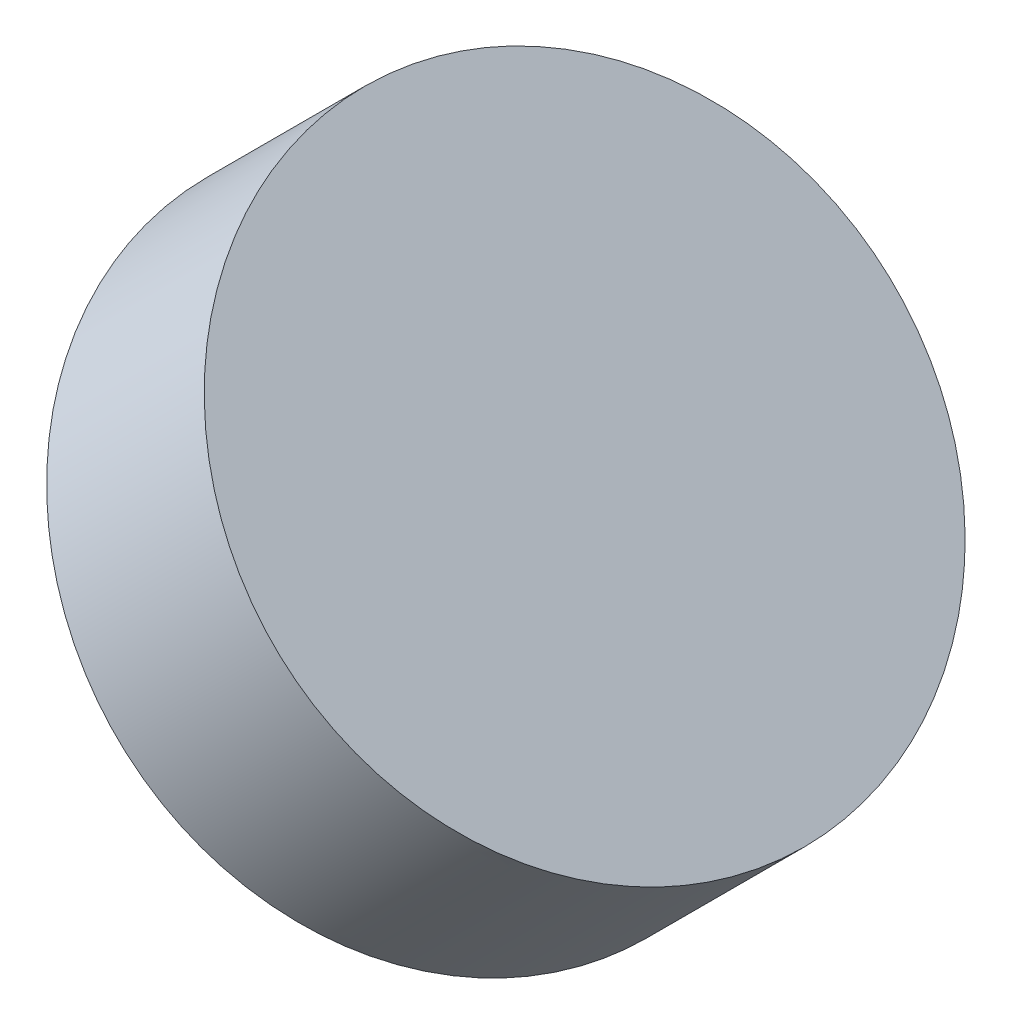
ISO-10303-21;
HEADER;
FILE_DESCRIPTION(('STEP AP214'),'2;1');
FILE_NAME('part.step','',(''),(''),'','','');
FILE_SCHEMA(('AUTOMOTIVE_DESIGN { 1 0 10303 214 1 1 1 1 }'));
ENDSEC;
DATA;
#1=APPLICATION_CONTEXT('core data for automotive mechanical design processes');
#2=APPLICATION_PROTOCOL_DEFINITION('international standard','automotive_design',2000,#1);
#3=PRODUCT_CONTEXT('',#1,'mechanical');
#4=PRODUCT('Part','Part','',(#3));
#5=PRODUCT_RELATED_PRODUCT_CATEGORY('part','',(#4));
#6=PRODUCT_DEFINITION_FORMATION('','',#4);
#7=PRODUCT_DEFINITION_CONTEXT('part definition',#1,'design');
#8=PRODUCT_DEFINITION('design','',#6,#7);
#9=PRODUCT_DEFINITION_SHAPE('','',#8);
#10=(LENGTH_UNIT() NAMED_UNIT(*) SI_UNIT(.MILLI.,.METRE.));
#11=(NAMED_UNIT(*) PLANE_ANGLE_UNIT() SI_UNIT($,.RADIAN.));
#12=(NAMED_UNIT(*) SI_UNIT($,.STERADIAN.) SOLID_ANGLE_UNIT());
#13=UNCERTAINTY_MEASURE_WITH_UNIT(LENGTH_MEASURE(1.E-05),#10,'distance_accuracy_value','');
#14=(GEOMETRIC_REPRESENTATION_CONTEXT(3) GLOBAL_UNCERTAINTY_ASSIGNED_CONTEXT((#13)) GLOBAL_UNIT_ASSIGNED_CONTEXT((#10,
#11,#12)) REPRESENTATION_CONTEXT('',''));
#15=CARTESIAN_POINT('',(0.,0.,0.));
#16=DIRECTION('',(0.,0.,1.));
#17=DIRECTION('',(1.,0.,0.));
#18=AXIS2_PLACEMENT_3D('',#15,#16,#17);
#19=CARTESIAN_POINT('',(15.2061360649185,25.4883691119521,12.5));
#20=CARTESIAN_POINT('',(15.2061360649185,25.4883691119521,12.6682299792076));
#21=CARTESIAN_POINT('',(15.2534599264889,25.4410452503816,13.0046899376229));
#22=CARTESIAN_POINT('',(15.4556103601578,25.2388948167128,13.4325454072684));
#23=CARTESIAN_POINT('',(15.7581498641119,24.9363553127587,13.7184292922025));
#24=CARTESIAN_POINT('',(16.1150195414016,24.5794856354689,13.8188183624877));
#25=CARTESIAN_POINT('',(16.4718892186914,24.2226159581791,13.7184292922025));
#26=CARTESIAN_POINT('',(16.7744287226455,23.920076454225,13.4325454072684));
#27=CARTESIAN_POINT('',(16.9765791563143,23.7179260205562,13.0046899376229));
#28=CARTESIAN_POINT('',(17.0475649486701,23.6469402282005,12.5));
#29=CARTESIAN_POINT('',(16.9765791563143,23.7179260205562,11.9953100623771));
#30=CARTESIAN_POINT('',(16.7744287226455,23.920076454225,11.5674545927316));
#31=CARTESIAN_POINT('',(16.4718892186914,24.2226159581791,11.2815707077975));
#32=CARTESIAN_POINT('',(16.1150195414016,24.5794856354689,11.1811816375123));
#33=CARTESIAN_POINT('',(15.7581498641118,24.9363553127587,11.2815707077975));
#34=CARTESIAN_POINT('',(15.4556103601578,25.2388948167128,11.5674545927316));
#35=CARTESIAN_POINT('',(15.2534599264889,25.4410452503816,11.9953100623771));
#36=CARTESIAN_POINT('',(15.2061360649185,25.4883691119521,12.3317700207924));
#37=CARTESIAN_POINT('',(15.2061360649185,25.4883691119521,12.5));
#38=B_SPLINE_CURVE_WITH_KNOTS('',3,(#19,#20,#21,#22,#23,#24,#25,#26,#27,#28,#29,#30,#31,#32,#33,
#34,#35,#36,#37),.UNSPECIFIED.,.T.,.F.,(4,1,1,1,1,1,1,1,1,1,1,1,1,1,1,1,4),(0.,0.0625,0.125,
0.1875,0.25,0.3125,0.375,0.4375,0.5,0.5625,0.625,0.6875,0.75,0.8125,0.875,0.9375,1.),.UNSPECIFIED.);
#39=DIRECTION('',(0.707106781186551,0.707106781186544,0.));
#40=VECTOR('',#39,1.);
#41=SURFACE_OF_LINEAR_EXTRUSION('',#38,#40);
#42=CARTESIAN_POINT('',(15.2061360649185,25.4883691119521,12.5));
#43=CARTESIAN_POINT('',(15.2061360577757,25.4883691190948,12.5168232400315));
#44=CARTESIAN_POINT('',(15.2063726904619,25.4881324864087,12.5336462920131));
#45=CARTESIAN_POINT('',(15.2073155725981,25.4871896042724,12.5672667861277));
#46=CARTESIAN_POINT('',(15.2080218416624,25.4864833352081,12.5840642271617));
#47=CARTESIAN_POINT('',(15.209900386229,25.4846047906416,12.6176078055949));
#48=CARTESIAN_POINT('',(15.2110726881151,25.4834324887555,12.6343539400354));
#49=CARTESIAN_POINT('',(15.2138796917333,25.4806254851372,12.6677693441755));
#50=CARTESIAN_POINT('',(15.2155144164853,25.4789907603852,12.6844386100066));
#51=CARTESIAN_POINT('',(15.2192426719177,25.4752625049529,12.7176746784822));
#52=CARTESIAN_POINT('',(15.2213362156754,25.4731689611951,12.7342414781923));
#53=CARTESIAN_POINT('',(15.2259785210311,25.4685266558395,12.7672470232649));
#54=CARTESIAN_POINT('',(15.228527282629,25.4659778942416,12.7836857686273));
#55=CARTESIAN_POINT('',(15.2340764386883,25.4604287381822,12.8164096084192));
#56=CARTESIAN_POINT('',(15.2370768202739,25.4574283565967,12.8326947072152));
#57=CARTESIAN_POINT('',(15.2435256316719,25.4509795451986,12.865085658272));
#58=CARTESIAN_POINT('',(15.24697403917,25.4475311377005,12.8811915194166));
#59=CARTESIAN_POINT('',(15.2543153120434,25.4401898648272,12.9131983921274));
#60=CARTESIAN_POINT('',(15.258208152243,25.4362970246276,12.9290994152403));
#61=CARTESIAN_POINT('',(15.2664347021672,25.4280704747034,12.9606710374439));
#62=CARTESIAN_POINT('',(15.2707683934718,25.4237367833987,12.9763416461307));
#63=CARTESIAN_POINT('',(15.2798730066104,25.4146321702601,13.0074267397893));
#64=CARTESIAN_POINT('',(15.2846439284445,25.4098612484261,13.0228412247612));
#65=CARTESIAN_POINT('',(15.2946126903099,25.3998924865606,13.0533922828395));
#66=CARTESIAN_POINT('',(15.2998105481643,25.3946946287062,13.0685288443114));
#67=CARTESIAN_POINT('',(15.3106229206853,25.3838822561853,13.0985023939195));
#68=CARTESIAN_POINT('',(15.3162374589271,25.3782677179435,13.1133393650447));
#69=CARTESIAN_POINT('',(15.3278729361971,25.3666322406735,13.1426920375979));
#70=CARTESIAN_POINT('',(15.3338938954459,25.3606112814247,13.1572077229933));
#71=CARTESIAN_POINT('',(15.3463319694185,25.3481732074521,13.1858961280244));
#72=CARTESIAN_POINT('',(15.3527490954302,25.3417560814404,13.2000688378719));
#73=CARTESIAN_POINT('',(15.3659692625331,25.3285359143374,13.2280495881575));
#74=CARTESIAN_POINT('',(15.3727723036243,25.3217328732462,13.2418576285956));
#75=CARTESIAN_POINT('',(15.386754062552,25.3077511143185,13.269087332709));
#76=CARTESIAN_POINT('',(15.3939327696742,25.3005724071963,13.2825090073868));
#77=CARTESIAN_POINT('',(15.4086556227345,25.2858495541361,13.3089442725482));
#78=CARTESIAN_POINT('',(15.4161997504605,25.27830542641,13.3219578833159));
#79=CARTESIAN_POINT('',(15.4316431995541,25.2628619773165,13.3475553096584));
#80=CARTESIAN_POINT('',(15.4395425007868,25.2549626760838,13.3601391495259));
#81=CARTESIAN_POINT('',(15.4556860612912,25.2388191155794,13.3848553483528));
#82=CARTESIAN_POINT('',(15.4639303061417,25.2305748707288,13.3969877261467));
#83=CARTESIAN_POINT('',(15.4807534376022,25.2137517392683,13.4207792268197));
#84=CARTESIAN_POINT('',(15.4893323242122,25.2051728526583,13.4324383496988));
#85=CARTESIAN_POINT('',(15.5068093160079,25.1876958608627,13.4552687919092));
#86=CARTESIAN_POINT('',(15.5157074345115,25.178797742359,13.4664400908458));
#87=CARTESIAN_POINT('',(15.5338075482592,25.1606976286113,13.4882804260036));
#88=CARTESIAN_POINT('',(15.5430095606808,25.1514956161897,13.4989494337501));
#89=CARTESIAN_POINT('',(15.5617021159389,25.1328030609316,13.5197706922247));
#90=CARTESIAN_POINT('',(15.5711926731184,25.1233125037521,13.5299229171972));
#91=CARTESIAN_POINT('',(15.5904469815467,25.1040581953238,13.5496961102986));
#92=CARTESIAN_POINT('',(15.6002107405754,25.0942944362951,13.5593170632752));
#93=CARTESIAN_POINT('',(15.6199961188451,25.0745090580255,13.578013202889));
#94=CARTESIAN_POINT('',(15.630017738086,25.0644874387846,13.5870883895262));
#95=CARTESIAN_POINT('',(15.6503035038249,25.0442016730456,13.6046784824281));
#96=CARTESIAN_POINT('',(15.6605676434015,25.033937533469,13.6131934046562));
#97=CARTESIAN_POINT('',(15.6813231172099,25.0131820596607,13.6296484544161));
#98=CARTESIAN_POINT('',(15.6918144401048,25.0026907367657,13.6375886105441));
#99=CARTESIAN_POINT('',(15.7130089402889,24.9814962365817,13.6528796144047));
#100=CARTESIAN_POINT('',(15.7237121055495,24.970793071321,13.6602304954777));
#101=CARTESIAN_POINT('',(15.7453149658892,24.9491902109814,13.6743284537079));
#102=CARTESIAN_POINT('',(15.7562146527414,24.9382905241292,13.6810755560706));
#103=CARTESIAN_POINT('',(15.7781951332609,24.9163100436096,13.6939514234514));
#104=CARTESIAN_POINT('',(15.7892759269283,24.9052292499423,13.7000801884696));
#105=CARTESIAN_POINT('',(15.8116004350826,24.882904741788,13.7117142869438));
#106=CARTESIAN_POINT('',(15.822844156355,24.8716610205156,13.7172195943501));
#107=CARTESIAN_POINT('',(15.8454764330893,24.8490287437813,13.7276017220132));
#108=CARTESIAN_POINT('',(15.8568649967159,24.8376401801546,13.7324785066663));
#109=CARTESIAN_POINT('',(15.8797688578725,24.8147363189981,13.7415985032046));
#110=CARTESIAN_POINT('',(15.8912841616842,24.8032210151863,13.7458416835324));
#111=CARTESIAN_POINT('',(15.9144234106507,24.7800817662198,13.7536893752988));
#112=CARTESIAN_POINT('',(15.926047358893,24.7684578179775,13.757293868528));
#113=CARTESIAN_POINT('',(15.9493858038428,24.7451193730278,13.7638590796947));
#114=CARTESIAN_POINT('',(15.9611003005501,24.7334048763204,13.7668197976322));
#115=CARTESIAN_POINT('',(15.9846017491575,24.709903427713,13.7720923471328));
#116=CARTESIAN_POINT('',(15.9963886989826,24.6981164778879,13.7744041971901));
#117=CARTESIAN_POINT('',(16.0200169608006,24.6744882160699,13.778373899388));
#118=CARTESIAN_POINT('',(16.0318582700577,24.6626469068128,13.7800317840835));
#119=CARTESIAN_POINT('',(16.0555771508079,24.6389280260626,13.7826884487377));
#120=CARTESIAN_POINT('',(16.06745472021,24.6270504566606,13.7836872660086));
#121=CARTESIAN_POINT('',(16.0912280407286,24.6032771361419,13.7850206972999));
#122=CARTESIAN_POINT('',(16.1031237910651,24.5913813858054,13.7853553390593));
#123=CARTESIAN_POINT('',(16.1269152917381,24.5675898851324,13.7853553390593));
#124=CARTESIAN_POINT('',(16.1388110420747,24.5556941347959,13.7850206972999));
#125=CARTESIAN_POINT('',(16.1625843625933,24.5319208142772,13.7836872660086));
#126=CARTESIAN_POINT('',(16.1744619319953,24.5200432448752,13.7826884487377));
#127=CARTESIAN_POINT('',(16.1981808127455,24.496324364125,13.7800317840835));
#128=CARTESIAN_POINT('',(16.2100221220026,24.4844830548679,13.778373899388));
#129=CARTESIAN_POINT('',(16.2336503838206,24.4608547930499,13.7744041971901));
#130=CARTESIAN_POINT('',(16.2454373336458,24.4490678432248,13.7720923471328));
#131=CARTESIAN_POINT('',(16.2689387822531,24.4255663946174,13.7668197976322));
#132=CARTESIAN_POINT('',(16.2806532789605,24.41385189791,13.7638590796947));
#133=CARTESIAN_POINT('',(16.3039917239102,24.3905134529603,13.757293868528));
#134=CARTESIAN_POINT('',(16.3156156721525,24.378889504718,13.7536893752988));
#135=CARTESIAN_POINT('',(16.338754921119,24.3557502557515,13.7458416835324));
#136=CARTESIAN_POINT('',(16.3502702249308,24.3442349519398,13.7415985032047));
#137=CARTESIAN_POINT('',(16.3731740860874,24.3213310907832,13.7324785066663));
#138=CARTESIAN_POINT('',(16.384562649714,24.3099425271566,13.7276017220132));
#139=CARTESIAN_POINT('',(16.4071949264483,24.2873102504223,13.7172195943501));
#140=CARTESIAN_POINT('',(16.4184386477207,24.2760665291498,13.7117142869438));
#141=CARTESIAN_POINT('',(16.440763155875,24.2537420209955,13.7000801884696));
#142=CARTESIAN_POINT('',(16.4518439495424,24.2426612273282,13.6939514234515));
#143=CARTESIAN_POINT('',(16.4738244300619,24.2206807468086,13.6810755560706));
#144=CARTESIAN_POINT('',(16.4847241169141,24.2097810599564,13.6743284537079));
#145=CARTESIAN_POINT('',(16.5063269772538,24.1881781996168,13.6602304954777));
#146=CARTESIAN_POINT('',(16.5170301425144,24.1774750343561,13.6528796144047));
#147=CARTESIAN_POINT('',(16.5382246426984,24.1562805341721,13.6375886105441));
#148=CARTESIAN_POINT('',(16.5487159655934,24.1457892112772,13.6296484544161));
#149=CARTESIAN_POINT('',(16.5694714394017,24.1250337374688,13.6131934046562));
#150=CARTESIAN_POINT('',(16.5797355789783,24.1147695978922,13.6046784824281));
#151=CARTESIAN_POINT('',(16.6000213447173,24.0944838321532,13.5870883895262));
#152=CARTESIAN_POINT('',(16.6100429639582,24.0844622129123,13.578013202889));
#153=CARTESIAN_POINT('',(16.6298283422278,24.0646768346427,13.5593170632752));
#154=CARTESIAN_POINT('',(16.6395921012566,24.054913075614,13.5496961102986));
#155=CARTESIAN_POINT('',(16.6588464096848,24.0356587671857,13.5299229171973));
#156=CARTESIAN_POINT('',(16.6683369668644,24.0261682100062,13.5197706922247));
#157=CARTESIAN_POINT('',(16.6870295221224,24.0074756547481,13.4989494337501));
#158=CARTESIAN_POINT('',(16.696231534544,23.9982736423265,13.4882804260036));
#159=CARTESIAN_POINT('',(16.7143316482917,23.9801735285788,13.4664400908458));
#160=CARTESIAN_POINT('',(16.7232297667954,23.9712754100751,13.4552687919092));
#161=CARTESIAN_POINT('',(16.7407067585911,23.9537984182795,13.4324383496988));
#162=CARTESIAN_POINT('',(16.749285645201,23.9452195316695,13.4207792268197));
#163=CARTESIAN_POINT('',(16.7661087766615,23.928396400209,13.3969877261467));
#164=CARTESIAN_POINT('',(16.7743530215121,23.9201521553585,13.3848553483528));
#165=CARTESIAN_POINT('',(16.7904965820165,23.904008594854,13.3601391495259));
#166=CARTESIAN_POINT('',(16.7983958832492,23.8961092936213,13.3475553096584));
#167=CARTESIAN_POINT('',(16.8138393323427,23.8806658445278,13.3219578833159));
#168=CARTESIAN_POINT('',(16.8213834600688,23.8731217168017,13.3089442725481));
#169=CARTESIAN_POINT('',(16.836106313129,23.8583988637415,13.2825090073868));
#170=CARTESIAN_POINT('',(16.8432850202512,23.8512201566193,13.269087332709));
#171=CARTESIAN_POINT('',(16.8572667791789,23.8372383976916,13.2418576285956));
#172=CARTESIAN_POINT('',(16.8640698202702,23.8304353566004,13.2280495881575));
#173=CARTESIAN_POINT('',(16.8772899873731,23.8172151894975,13.2000688378719));
#174=CARTESIAN_POINT('',(16.8837071133848,23.8107980634858,13.1858961280244));
#175=CARTESIAN_POINT('',(16.8961451873574,23.7983599895132,13.1572077229933));
#176=CARTESIAN_POINT('',(16.9021661466062,23.7923390302643,13.1426920375979));
#177=CARTESIAN_POINT('',(16.9138016238762,23.7807035529944,13.1133393650447));
#178=CARTESIAN_POINT('',(16.919416162118,23.7750890147526,13.0985023939194));
#179=CARTESIAN_POINT('',(16.9302285346389,23.7642766422316,13.0685288443114));
#180=CARTESIAN_POINT('',(16.9354263924933,23.7590787843772,13.0533922828395));
#181=CARTESIAN_POINT('',(16.9453951543588,23.7491100225118,13.0228412247611));
#182=CARTESIAN_POINT('',(16.9501660761928,23.7443391006777,13.0074267397891));
#183=CARTESIAN_POINT('',(16.9592706893315,23.7352344875391,12.9763416461309));
#184=CARTESIAN_POINT('',(16.9636043806361,23.7309007962344,12.9606710374447));
#185=CARTESIAN_POINT('',(16.9718309305602,23.7226742463103,12.9290994152396));
#186=CARTESIAN_POINT('',(16.9757237707597,23.7187814061108,12.9131983921246));
#187=CARTESIAN_POINT('',(16.9830650436334,23.7114401332371,12.8811915194195));
#188=CARTESIAN_POINT('',(16.986513451132,23.7079917257385,12.8650856582828));
#189=CARTESIAN_POINT('',(16.9929622625287,23.7015429143418,12.8326947072045));
#190=CARTESIAN_POINT('',(16.9959626441123,23.6985425327582,12.816409608379));
#191=CARTESIAN_POINT('',(17.0015118001769,23.6929933766936,12.7836857686675));
#192=CARTESIAN_POINT('',(17.0040605617821,23.6904446150885,12.7672470234149));
#193=CARTESIAN_POINT('',(17.008702867118,23.6858023097526,12.7342414780423));
#194=CARTESIAN_POINT('',(17.0107964108488,23.6837087660218,12.7176746779224));
#195=CARTESIAN_POINT('',(17.0145246663548,23.6799805105158,12.6844386105664));
#196=CARTESIAN_POINT('',(17.0161593912074,23.6783457856632,12.6677693462647));
#197=CARTESIAN_POINT('',(17.0189663945508,23.6755387823198,12.6343539379464));
#198=CARTESIAN_POINT('',(17.0201386960614,23.6743664808091,12.6176077977987));
#199=CARTESIAN_POINT('',(17.0220172416537,23.6724879352168,12.5840642349575));
#200=CARTESIAN_POINT('',(17.0227235121192,23.6717816647514,12.5672668152211));
#201=CARTESIAN_POINT('',(17.0236663904274,23.6708387864431,12.533646262921));
#202=CARTESIAN_POINT('',(17.0239030178848,23.6706021589857,12.5168231314605));
#203=CARTESIAN_POINT('',(17.0239030178848,23.6706021589857,12.4831768685395));
#204=CARTESIAN_POINT('',(17.0236663904274,23.6708387864431,12.466353737079));
#205=CARTESIAN_POINT('',(17.0227235121192,23.6717816647514,12.4327331847789));
#206=CARTESIAN_POINT('',(17.0220172416537,23.6724879352168,12.4159357650425));
#207=CARTESIAN_POINT('',(17.0201386960614,23.6743664808091,12.3823922022013));
#208=CARTESIAN_POINT('',(17.0189663945508,23.6755387823198,12.3656460620536));
#209=CARTESIAN_POINT('',(17.0161593912074,23.6783457856632,12.3322306537353));
#210=CARTESIAN_POINT('',(17.0145246663548,23.6799805105158,12.3155613894336));
#211=CARTESIAN_POINT('',(17.0107964108488,23.6837087660218,12.2823253220776));
#212=CARTESIAN_POINT('',(17.008702867118,23.6858023097526,12.2657585219577));
#213=CARTESIAN_POINT('',(17.0040605617821,23.6904446150885,12.2327529765851));
#214=CARTESIAN_POINT('',(17.0015118001769,23.6929933766936,12.2163142313325));
#215=CARTESIAN_POINT('',(16.9959626441123,23.6985425327582,12.183590391621));
#216=CARTESIAN_POINT('',(16.9929622625287,23.7015429143418,12.1673052927955));
#217=CARTESIAN_POINT('',(16.986513451132,23.7079917257385,12.1349143417172));
#218=CARTESIAN_POINT('',(16.9830650436334,23.7114401332371,12.1188084805805));
#219=CARTESIAN_POINT('',(16.9757237707597,23.7187814061108,12.0868016078754));
#220=CARTESIAN_POINT('',(16.9718309305602,23.7226742463103,12.0709005847605));
#221=CARTESIAN_POINT('',(16.9636043806361,23.7309007962344,12.0393289625553));
#222=CARTESIAN_POINT('',(16.9592706893315,23.7352344875391,12.0236583538691));
#223=CARTESIAN_POINT('',(16.9501660761928,23.7443391006777,11.9925732602109));
#224=CARTESIAN_POINT('',(16.9453951543588,23.7491100225118,11.9771587752389));
#225=CARTESIAN_POINT('',(16.9354263924933,23.7590787843772,11.9466077171605));
#226=CARTESIAN_POINT('',(16.9302285346389,23.7642766422316,11.9314711556886));
#227=CARTESIAN_POINT('',(16.919416162118,23.7750890147526,11.9014976060806));
#228=CARTESIAN_POINT('',(16.9138016238762,23.7807035529944,11.8866606349553));
#229=CARTESIAN_POINT('',(16.9021661466062,23.7923390302643,11.8573079624021));
#230=CARTESIAN_POINT('',(16.8961451873574,23.7983599895132,11.8427922770067));
#231=CARTESIAN_POINT('',(16.8837071133848,23.8107980634857,11.8141038719756));
#232=CARTESIAN_POINT('',(16.8772899873731,23.8172151894975,11.7999311621282));
#233=CARTESIAN_POINT('',(16.8640698202702,23.8304353566004,11.7719504118426));
#234=CARTESIAN_POINT('',(16.8572667791789,23.8372383976916,11.7581423714044));
#235=CARTESIAN_POINT('',(16.8432850202512,23.8512201566193,11.730912667291));
#236=CARTESIAN_POINT('',(16.836106313129,23.8583988637415,11.7174909926133));
#237=CARTESIAN_POINT('',(16.8213834600688,23.8731217168017,11.6910557274519));
#238=CARTESIAN_POINT('',(16.8138393323427,23.8806658445278,11.6780421166841));
#239=CARTESIAN_POINT('',(16.7983958832492,23.8961092936213,11.6524446903416));
#240=CARTESIAN_POINT('',(16.7904965820165,23.904008594854,11.6398608504741));
#241=CARTESIAN_POINT('',(16.7743530215121,23.9201521553585,11.6151446516472));
#242=CARTESIAN_POINT('',(16.7661087766615,23.928396400209,11.6030122738533));
#243=CARTESIAN_POINT('',(16.749285645201,23.9452195316695,11.5792207731803));
#244=CARTESIAN_POINT('',(16.7407067585911,23.9537984182795,11.5675616503012));
#245=CARTESIAN_POINT('',(16.7232297667954,23.9712754100751,11.5447312080908));
#246=CARTESIAN_POINT('',(16.7143316482917,23.9801735285788,11.5335599091543));
#247=CARTESIAN_POINT('',(16.696231534544,23.9982736423265,11.5117195739964));
#248=CARTESIAN_POINT('',(16.6870295221224,24.0074756547481,11.5010505662499));
#249=CARTESIAN_POINT('',(16.6683369668644,24.0261682100062,11.4802293077753));
#250=CARTESIAN_POINT('',(16.6588464096848,24.0356587671857,11.4700770828028));
#251=CARTESIAN_POINT('',(16.6395921012566,24.054913075614,11.4503038897014));
#252=CARTESIAN_POINT('',(16.6298283422278,24.0646768346427,11.4406829367248));
#253=CARTESIAN_POINT('',(16.6100429639582,24.0844622129123,11.421986797111));
#254=CARTESIAN_POINT('',(16.6000213447173,24.0944838321532,11.4129116104738));
#255=CARTESIAN_POINT('',(16.5797355789783,24.1147695978922,11.395321517572));
#256=CARTESIAN_POINT('',(16.5694714394017,24.1250337374688,11.3868065953438));
#257=CARTESIAN_POINT('',(16.5487159655934,24.1457892112772,11.3703515455839));
#258=CARTESIAN_POINT('',(16.5382246426984,24.1562805341721,11.3624113894559));
#259=CARTESIAN_POINT('',(16.5170301425144,24.1774750343561,11.3471203855953));
#260=CARTESIAN_POINT('',(16.5063269772538,24.1881781996168,11.3397695045223));
#261=CARTESIAN_POINT('',(16.4847241169141,24.2097810599564,11.3256715462921));
#262=CARTESIAN_POINT('',(16.4738244300619,24.2206807468086,11.3189244439294));
#263=CARTESIAN_POINT('',(16.4518439495424,24.2426612273282,11.3060485765486));
#264=CARTESIAN_POINT('',(16.440763155875,24.2537420209955,11.2999198115304));
#265=CARTESIAN_POINT('',(16.4184386477207,24.2760665291498,11.2882857130562));
#266=CARTESIAN_POINT('',(16.4071949264483,24.2873102504222,11.2827804056499));
#267=CARTESIAN_POINT('',(16.384562649714,24.3099425271566,11.2723982779868));
#268=CARTESIAN_POINT('',(16.3731740860874,24.3213310907832,11.2675214933337));
#269=CARTESIAN_POINT('',(16.3502702249308,24.3442349519397,11.2584014967954));
#270=CARTESIAN_POINT('',(16.338754921119,24.3557502557515,11.2541583164676));
#271=CARTESIAN_POINT('',(16.3156156721525,24.378889504718,11.2463106247012));
#272=CARTESIAN_POINT('',(16.3039917239102,24.3905134529603,11.242706131472));
#273=CARTESIAN_POINT('',(16.2806532789605,24.41385189791,11.2361409203053));
#274=CARTESIAN_POINT('',(16.2689387822531,24.4255663946174,11.2331802023678));
#275=CARTESIAN_POINT('',(16.2454373336458,24.4490678432248,11.2279076528672));
#276=CARTESIAN_POINT('',(16.2336503838206,24.4608547930499,11.2255958028099));
#277=CARTESIAN_POINT('',(16.2100221220026,24.4844830548679,11.221626100612));
#278=CARTESIAN_POINT('',(16.1981808127455,24.496324364125,11.2199682159165));
#279=CARTESIAN_POINT('',(16.1744619319953,24.5200432448752,11.2173115512623));
#280=CARTESIAN_POINT('',(16.1625843625933,24.5319208142772,11.2163127339914));
#281=CARTESIAN_POINT('',(16.1388110420747,24.5556941347959,11.2149793027001));
#282=CARTESIAN_POINT('',(16.1269152917382,24.5675898851324,11.2146446609407));
#283=CARTESIAN_POINT('',(16.1031237910651,24.5913813858054,11.2146446609407));
#284=CARTESIAN_POINT('',(16.0912280407286,24.6032771361419,11.2149793027001));
#285=CARTESIAN_POINT('',(16.06745472021,24.6270504566606,11.2163127339914));
#286=CARTESIAN_POINT('',(16.0555771508079,24.6389280260626,11.2173115512623));
#287=CARTESIAN_POINT('',(16.0318582700577,24.6626469068128,11.2199682159165));
#288=CARTESIAN_POINT('',(16.0200169608006,24.6744882160699,11.221626100612));
#289=CARTESIAN_POINT('',(15.9963886989827,24.6981164778879,11.2255958028099));
#290=CARTESIAN_POINT('',(15.9846017491575,24.709903427713,11.2279076528672));
#291=CARTESIAN_POINT('',(15.9611003005501,24.7334048763204,11.2331802023678));
#292=CARTESIAN_POINT('',(15.9493858038428,24.7451193730278,11.2361409203053));
#293=CARTESIAN_POINT('',(15.9260473588931,24.7684578179775,11.242706131472));
#294=CARTESIAN_POINT('',(15.9144234106507,24.7800817662198,11.2463106247012));
#295=CARTESIAN_POINT('',(15.8912841616842,24.8032210151863,11.2541583164676));
#296=CARTESIAN_POINT('',(15.8797688578725,24.8147363189981,11.2584014967954));
#297=CARTESIAN_POINT('',(15.8568649967159,24.8376401801546,11.2675214933337));
#298=CARTESIAN_POINT('',(15.8454764330893,24.8490287437813,11.2723982779868));
#299=CARTESIAN_POINT('',(15.822844156355,24.8716610205156,11.2827804056499));
#300=CARTESIAN_POINT('',(15.8116004350826,24.882904741788,11.2882857130562));
#301=CARTESIAN_POINT('',(15.7892759269283,24.9052292499423,11.2999198115304));
#302=CARTESIAN_POINT('',(15.7781951332609,24.9163100436096,11.3060485765486));
#303=CARTESIAN_POINT('',(15.7562146527414,24.9382905241292,11.3189244439294));
#304=CARTESIAN_POINT('',(15.7453149658892,24.9491902109814,11.3256715462921));
#305=CARTESIAN_POINT('',(15.7237121055495,24.970793071321,11.3397695045223));
#306=CARTESIAN_POINT('',(15.7130089402889,24.9814962365817,11.3471203855953));
#307=CARTESIAN_POINT('',(15.6918144401048,25.0026907367657,11.3624113894559));
#308=CARTESIAN_POINT('',(15.6813231172099,25.0131820596607,11.3703515455839));
#309=CARTESIAN_POINT('',(15.6605676434015,25.033937533469,11.3868065953438));
#310=CARTESIAN_POINT('',(15.6503035038249,25.0442016730456,11.3953215175719));
#311=CARTESIAN_POINT('',(15.630017738086,25.0644874387846,11.4129116104738));
#312=CARTESIAN_POINT('',(15.6199961188451,25.0745090580255,11.421986797111));
#313=CARTESIAN_POINT('',(15.6002107405754,25.0942944362951,11.4406829367248));
#314=CARTESIAN_POINT('',(15.5904469815467,25.1040581953238,11.4503038897014));
#315=CARTESIAN_POINT('',(15.5711926731184,25.1233125037521,11.4700770828028));
#316=CARTESIAN_POINT('',(15.5617021159389,25.1328030609316,11.4802293077753));
#317=CARTESIAN_POINT('',(15.5430095606808,25.1514956161897,11.5010505662499));
#318=CARTESIAN_POINT('',(15.5338075482592,25.1606976286113,11.5117195739964));
#319=CARTESIAN_POINT('',(15.5157074345115,25.178797742359,11.5335599091542));
#320=CARTESIAN_POINT('',(15.5068093160079,25.1876958608627,11.5447312080908));
#321=CARTESIAN_POINT('',(15.4893323242122,25.2051728526583,11.5675616503012));
#322=CARTESIAN_POINT('',(15.4807534376022,25.2137517392683,11.5792207731803));
#323=CARTESIAN_POINT('',(15.4639303061417,25.2305748707288,11.6030122738533));
#324=CARTESIAN_POINT('',(15.4556860612912,25.2388191155794,11.6151446516472));
#325=CARTESIAN_POINT('',(15.4395425007868,25.2549626760838,11.6398608504741));
#326=CARTESIAN_POINT('',(15.4316431995541,25.2628619773165,11.6524446903416));
#327=CARTESIAN_POINT('',(15.4161997504605,25.27830542641,11.6780421166841));
#328=CARTESIAN_POINT('',(15.4086556227345,25.2858495541361,11.6910557274518));
#329=CARTESIAN_POINT('',(15.3939327696742,25.3005724071963,11.7174909926132));
#330=CARTESIAN_POINT('',(15.386754062552,25.3077511143185,11.730912667291));
#331=CARTESIAN_POINT('',(15.3727723036243,25.3217328732462,11.7581423714044));
#332=CARTESIAN_POINT('',(15.3659692625331,25.3285359143374,11.7719504118425));
#333=CARTESIAN_POINT('',(15.3527490954302,25.3417560814404,11.7999311621281));
#334=CARTESIAN_POINT('',(15.3463319694185,25.3481732074521,11.8141038719756));
#335=CARTESIAN_POINT('',(15.3338938954459,25.3606112814247,11.8427922770067));
#336=CARTESIAN_POINT('',(15.3278729361971,25.3666322406735,11.8573079624021));
#337=CARTESIAN_POINT('',(15.3162374589271,25.3782677179435,11.8866606349553));
#338=CARTESIAN_POINT('',(15.3106229206853,25.3838822561853,11.9014976060805));
#339=CARTESIAN_POINT('',(15.2998105481643,25.3946946287062,11.9314711556886));
#340=CARTESIAN_POINT('',(15.29461269031,25.3998924865606,11.9466077171605));
#341=CARTESIAN_POINT('',(15.2846439284445,25.4098612484261,11.9771587752388));
#342=CARTESIAN_POINT('',(15.2798730066104,25.4146321702601,11.9925732602107));
#343=CARTESIAN_POINT('',(15.2707683934718,25.4237367833987,12.0236583538693));
#344=CARTESIAN_POINT('',(15.2664347021672,25.4280704747034,12.0393289625561));
#345=CARTESIAN_POINT('',(15.258208152243,25.4362970246276,12.0709005847597));
#346=CARTESIAN_POINT('',(15.2543153120434,25.4401898648272,12.0868016078726));
#347=CARTESIAN_POINT('',(15.24697403917,25.4475311377005,12.1188084805834));
#348=CARTESIAN_POINT('',(15.2435256316719,25.4509795451986,12.134914341728));
#349=CARTESIAN_POINT('',(15.2370768202739,25.4574283565967,12.1673052927848));
#350=CARTESIAN_POINT('',(15.2340764386883,25.4604287381822,12.1835903915808));
#351=CARTESIAN_POINT('',(15.228527282629,25.4659778942416,12.2163142313727));
#352=CARTESIAN_POINT('',(15.2259785210311,25.4685266558395,12.2327529767351));
#353=CARTESIAN_POINT('',(15.2213362156754,25.4731689611951,12.2657585218077));
#354=CARTESIAN_POINT('',(15.2192426719177,25.4752625049529,12.2823253215178));
#355=CARTESIAN_POINT('',(15.2155144164853,25.4789907603852,12.3155613899934));
#356=CARTESIAN_POINT('',(15.2138796917333,25.4806254851372,12.3322306558245));
#357=CARTESIAN_POINT('',(15.2110726881151,25.4834324887555,12.3656460599646));
#358=CARTESIAN_POINT('',(15.209900386229,25.4846047906416,12.3823921944051));
#359=CARTESIAN_POINT('',(15.2080218416624,25.4864833352081,12.4159357728383));
#360=CARTESIAN_POINT('',(15.2073155725981,25.4871896042724,12.4327332138723));
#361=CARTESIAN_POINT('',(15.2063726904619,25.4881324864087,12.4663537079869));
#362=CARTESIAN_POINT('',(15.2061360577757,25.4883691190948,12.4831767599685));
#363=CARTESIAN_POINT('',(15.2061360649185,25.4883691119521,12.5));
#364=B_SPLINE_CURVE_WITH_KNOTS('',3,(#42,#43,#44,#45,#46,#47,#48,#49,#50,#51,#52,#53,#54,#55,
#56,#57,#58,#59,#60,#61,#62,#63,#64,#65,#66,#67,#68,#69,#70,#71,#72,#73,#74,#75,#76,#77,#78,#79,
#80,#81,#82,#83,#84,#85,#86,#87,#88,#89,#90,#91,#92,#93,#94,#95,#96,#97,#98,#99,#100,#101,#102,
#103,#104,#105,#106,#107,#108,#109,#110,#111,#112,#113,#114,#115,#116,#117,#118,#119,#120,#121,
#122,#123,#124,#125,#126,#127,#128,#129,#130,#131,#132,#133,#134,#135,#136,#137,#138,#139,#140,
#141,#142,#143,#144,#145,#146,#147,#148,#149,#150,#151,#152,#153,#154,#155,#156,#157,#158,#159,
#160,#161,#162,#163,#164,#165,#166,#167,#168,#169,#170,#171,#172,#173,#174,#175,#176,#177,#178,
#179,#180,#181,#182,#183,#184,#185,#186,#187,#188,#189,#190,#191,#192,#193,#194,#195,#196,#197,
#198,#199,#200,#201,#202,#203,#204,#205,#206,#207,#208,#209,#210,#211,#212,#213,#214,#215,#216,
#217,#218,#219,#220,#221,#222,#223,#224,#225,#226,#227,#228,#229,#230,#231,#232,#233,#234,#235,
#236,#237,#238,#239,#240,#241,#242,#243,#244,#245,#246,#247,#248,#249,#250,#251,#252,#253,#254,
#255,#256,#257,#258,#259,#260,#261,#262,#263,#264,#265,#266,#267,#268,#269,#270,#271,#272,#273,
#274,#275,#276,#277,#278,#279,#280,#281,#282,#283,#284,#285,#286,#287,#288,#289,#290,#291,#292,
#293,#294,#295,#296,#297,#298,#299,#300,#301,#302,#303,#304,#305,#306,#307,#308,#309,#310,#311,
#312,#313,#314,#315,#316,#317,#318,#319,#320,#321,#322,#323,#324,#325,#326,#327,#328,#329,#330,
#331,#332,#333,#334,#335,#336,#337,#338,#339,#340,#341,#342,#343,#344,#345,#346,#347,#348,#349,
#350,#351,#352,#353,#354,#355,#356,#357,#358,#359,#360,#361,#362,#363),.UNSPECIFIED.,.F.,.F.,(4,
2,2,2,2,2,2,2,2,2,2,2,2,2,2,2,2,2,2,2,2,2,2,2,2,2,2,2,2,2,2,2,2,2,2,2,2,2,2,2,2,2,2,2,2,2,2,2,2,
2,2,2,2,2,2,2,2,2,2,2,2,2,2,2,2,2,2,2,2,2,2,2,2,2,2,2,2,2,2,2,2,2,2,2,2,2,2,2,2,2,2,2,2,2,2,2,2,
2,2,2,2,2,2,2,2,2,2,2,2,2,2,2,2,2,2,2,2,2,2,2,2,2,2,2,2,2,2,2,2,2,2,2,2,2,2,2,2,2,2,2,2,2,2,2,2,
2,2,2,2,2,2,2,2,2,2,2,2,2,2,2,4),(0.,0.0504661232713483,0.100934354381394,0.151405443093708,
0.201879044740986,0.25235408518986,0.302829125638735,0.353302727286008,0.403773815998326,
0.454242047108368,0.504708170379721,0.555174293651067,0.605642524761113,0.656113613473428,
0.706587215120709,0.75706225556958,0.807537296018454,0.858010897665733,0.908481986378046,
0.958950217488093,1.00941634075944,1.05988246403079,1.11035069514084,1.16082178385315,
1.21129538550043,1.2617704259493,1.31224546639818,1.36271906804546,1.41319015675777,
1.46365838786782,1.51412451113917,1.56459063441052,1.61505886552056,1.66552995423288,
1.71600355588016,1.76647859632903,1.8169536367779,1.86742723842518,1.91789832713749,
1.96836655824754,2.01883268151889,2.06929880479024,2.11976703590028,2.1702381246126,
2.22071172625988,2.27118676670875,2.32166180715763,2.3721354088049,2.42260649751722,
2.47307472862726,2.52354085189861,2.57400697516996,2.62447520628001,2.67494629499232,
2.7254198966396,2.77589493708847,2.82636997753734,2.87684357918462,2.92731466789694,
2.97778289900698,3.02824902227834,3.07871514554969,3.12918337665973,3.17965446537205,
3.23012806701932,3.2806031074682,3.33107814791707,3.38155174956435,3.43202283827666,
3.48249106938671,3.53295719265806,3.58342331592941,3.63389154703945,3.68436263575177,
3.73483623739904,3.78531127784792,3.83578631829679,3.88625991994407,3.93673100865638,
3.98719923976643,4.03766536303778,4.08813148630912,4.13859971741917,4.18907080613149,
4.23954440777876,4.29001944822764,4.34049448867651,4.39096809032379,4.44143917903611,
4.49190741014615,4.5423735334175,4.59283965668885,4.64330788779889,4.69377897651121,
4.74425257815849,4.79472761860736,4.84520265905624,4.89567626070351,4.94614734941583,
4.99661558052588,5.04708170379722,5.09754782706858,5.14801605817862,5.19848714689093,
5.24896074853821,5.29943578898708,5.34991082943596,5.40038443108323,5.45085551979555,
5.50132375090559,5.55178987417695,5.60225599744829,5.65272422855833,5.70319531727065,
5.75366891891793,5.80414395936681,5.85461899981568,5.90509260146295,5.95556369017527,
6.00603192128531,6.05649804455666,6.10696416782802,6.15743239893806,6.20790348765038,
6.25837708929765,6.30885212974653,6.35932717019541,6.40980077184268,6.460271860555,
6.51074009166504,6.56120621493639,6.61167233820774,6.66214056931779,6.71261165803011,
6.76308525967738,6.81356030012625,6.86403534057513,6.9145089422224,6.96498003093472,
7.01544826204476,7.06591438531611,7.11638050858746,7.16684873969751,7.21731982840982,
7.2677934300571,7.31826847050597,7.36874351095485,7.41921711260213,7.46968820131444,
7.52015643242449,7.57062255569584,7.62108867896719,7.67155691007723,7.72202799878955,
7.77250160043683,7.8229766408857,7.87345168133458,7.92392528298185,7.97439637169417,
8.02486460280421,8.07533072607556),.UNSPECIFIED.);
#365=CARTESIAN_POINT('',(15.2061360649185,25.4883691119521,12.5));
#366=VERTEX_POINT('',#365);
#367=EDGE_CURVE('E10',#366,#366,#364,.T.);
#368=ORIENTED_EDGE('',*,*,#367,.T.);
#369=EDGE_LOOP('',(#368));
#370=FACE_BOUND('',#369,.T.);
#371=CARTESIAN_POINT('',(15.8581763697021,26.1404094167357,12.5));
#372=CARTESIAN_POINT('',(15.8581763697021,26.1404094167357,12.3317700207924));
#373=CARTESIAN_POINT('',(15.9055002312726,26.0930855551652,11.9953100623771));
#374=CARTESIAN_POINT('',(16.1076506649414,25.8909351214964,11.5674545927316));
#375=CARTESIAN_POINT('',(16.4101901688955,25.5883956175423,11.2815707077975));
#376=CARTESIAN_POINT('',(16.7670598461853,25.2315259402525,11.1811816375123));
#377=CARTESIAN_POINT('',(17.123929523475,24.8746562629627,11.2815707077975));
#378=CARTESIAN_POINT('',(17.4264690274291,24.5721167590087,11.5674545927316));
#379=CARTESIAN_POINT('',(17.628619461098,24.3699663253398,11.9953100623771));
#380=CARTESIAN_POINT('',(17.6996052534537,24.2989805329841,12.5));
#381=CARTESIAN_POINT('',(17.628619461098,24.3699663253398,13.0046899376229));
#382=CARTESIAN_POINT('',(17.4264690274291,24.5721167590087,13.4325454072684));
#383=CARTESIAN_POINT('',(17.123929523475,24.8746562629628,13.7184292922025));
#384=CARTESIAN_POINT('',(16.7670598461853,25.2315259402525,13.8188183624877));
#385=CARTESIAN_POINT('',(16.4101901688955,25.5883956175423,13.7184292922025));
#386=CARTESIAN_POINT('',(16.1076506649414,25.8909351214964,13.4325454072684));
#387=CARTESIAN_POINT('',(15.9055002312726,26.0930855551652,13.0046899376229));
#388=CARTESIAN_POINT('',(15.8581763697021,26.1404094167357,12.6682299792076));
#389=CARTESIAN_POINT('',(15.8581763697021,26.1404094167357,12.5));
#390=B_SPLINE_CURVE_WITH_KNOTS('',3,(#371,#372,#373,#374,#375,#376,#377,#378,#379,#380,#381,
#382,#383,#384,#385,#386,#387,#388,#389),.UNSPECIFIED.,.T.,.F.,(4,1,1,1,1,1,1,1,1,1,1,1,1,1,1,1,
4),(0.,0.0625,0.125,0.1875,0.25,0.3125,0.375,0.4375,0.5,0.5625,0.625,0.6875,0.75,0.8125,0.875,
0.9375,1.),.UNSPECIFIED.);
#391=CARTESIAN_POINT('',(15.8581763697021,26.1404094167357,12.5));
#392=VERTEX_POINT('',#391);
#393=EDGE_CURVE('E25',#392,#392,#390,.F.);
#394=ORIENTED_EDGE('',*,*,#393,.F.);
#395=EDGE_LOOP('',(#394));
#396=FACE_BOUND('',#395,.T.);
#397=ADVANCED_FACE('F15',(#370,#396),#41,.T.);
#398=CARTESIAN_POINT('',(34.8295432811465,5.86496189572387,0.));
#399=DIRECTION('',(0.707106781186551,0.707106781186544,0.));
#400=DIRECTION('',(-0.707106781186544,0.707106781186551,0.));
#401=AXIS2_PLACEMENT_3D('',#398,#399,#400);
#402=PLANE('',#401);
#403=ORIENTED_EDGE('',*,*,#367,.F.);
#404=EDGE_LOOP('',(#403));
#405=FACE_BOUND('',#404,.T.);
#406=ADVANCED_FACE('F63',(#405),#402,.F.);
#407=CARTESIAN_POINT('',(35.4815835859301,6.51700220050751,0.));
#408=DIRECTION('',(0.707106781186551,0.707106781186544,0.));
#409=DIRECTION('',(-0.707106781186544,0.707106781186551,0.));
#410=AXIS2_PLACEMENT_3D('',#407,#408,#409);
#411=PLANE('',#410);
#412=ORIENTED_EDGE('',*,*,#393,.T.);
#413=EDGE_LOOP('',(#412));
#414=FACE_BOUND('',#413,.T.);
#415=ADVANCED_FACE('F32',(#414),#411,.T.);
#416=CLOSED_SHELL('',(#397,#406,#415));
#417=MANIFOLD_SOLID_BREP('B1',#416);
#418=ADVANCED_BREP_SHAPE_REPRESENTATION('',(#18,#417),#14);
#419=SHAPE_DEFINITION_REPRESENTATION(#9,#418);
ENDSEC;
END-ISO-10303-21;
